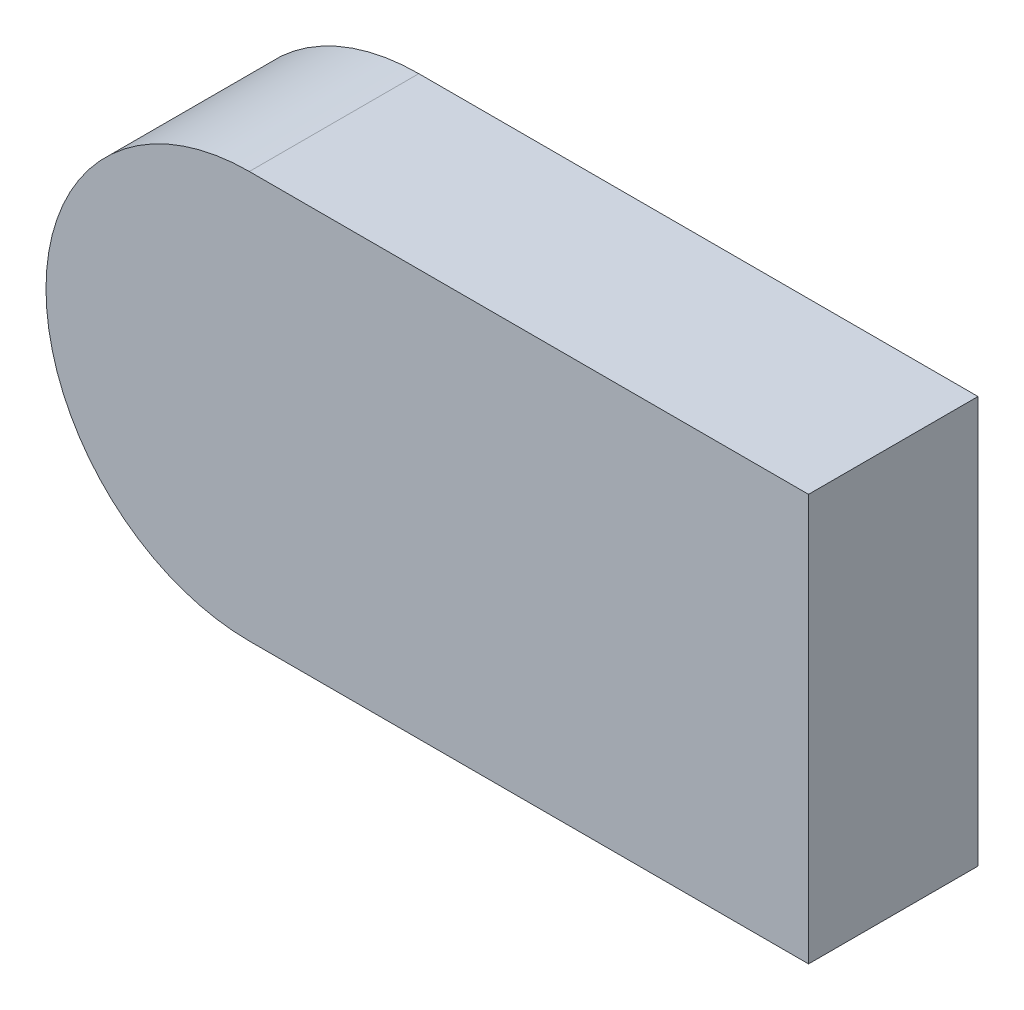
ISO-10303-21;
HEADER;
FILE_DESCRIPTION(('STEP AP214'),'2;1');
FILE_NAME('part.step','',(''),(''),'','','');
FILE_SCHEMA(('AUTOMOTIVE_DESIGN { 1 0 10303 214 1 1 1 1 }'));
ENDSEC;
DATA;
#1=APPLICATION_CONTEXT('core data for automotive mechanical design processes');
#2=APPLICATION_PROTOCOL_DEFINITION('international standard','automotive_design',2000,#1);
#3=PRODUCT_CONTEXT('',#1,'mechanical');
#4=PRODUCT('Part','Part','',(#3));
#5=PRODUCT_RELATED_PRODUCT_CATEGORY('part','',(#4));
#6=PRODUCT_DEFINITION_FORMATION('','',#4);
#7=PRODUCT_DEFINITION_CONTEXT('part definition',#1,'design');
#8=PRODUCT_DEFINITION('design','',#6,#7);
#9=PRODUCT_DEFINITION_SHAPE('','',#8);
#10=(LENGTH_UNIT() NAMED_UNIT(*) SI_UNIT(.MILLI.,.METRE.));
#11=(NAMED_UNIT(*) PLANE_ANGLE_UNIT() SI_UNIT($,.RADIAN.));
#12=(NAMED_UNIT(*) SI_UNIT($,.STERADIAN.) SOLID_ANGLE_UNIT());
#13=UNCERTAINTY_MEASURE_WITH_UNIT(LENGTH_MEASURE(1.E-05),#10,'distance_accuracy_value','');
#14=(GEOMETRIC_REPRESENTATION_CONTEXT(3) GLOBAL_UNCERTAINTY_ASSIGNED_CONTEXT((#13)) GLOBAL_UNIT_ASSIGNED_CONTEXT((#10,
#11,#12)) REPRESENTATION_CONTEXT('',''));
#15=CARTESIAN_POINT('',(0.,0.,0.));
#16=DIRECTION('',(0.,0.,1.));
#17=DIRECTION('',(1.,0.,0.));
#18=AXIS2_PLACEMENT_3D('',#15,#16,#17);
#19=CARTESIAN_POINT('',(4.05,-2.87,0.));
#20=DIRECTION('',(0.,-1.,0.));
#21=DIRECTION('',(-1.,0.,0.));
#22=AXIS2_PLACEMENT_3D('',#19,#20,#21);
#23=PLANE('',#22);
#24=DIRECTION('',(0.,0.,1.));
#25=VECTOR('',#24,1.);
#26=CARTESIAN_POINT('',(4.05,-2.87,0.));
#27=LINE('',#26,#25);
#28=CARTESIAN_POINT('',(4.05,-2.87,0.));
#29=VERTEX_POINT('',#28);
#30=CARTESIAN_POINT('',(4.05,-2.87,0.1));
#31=VERTEX_POINT('',#30);
#32=EDGE_CURVE('E11',#29,#31,#27,.T.);
#33=ORIENTED_EDGE('',*,*,#32,.T.);
#34=DIRECTION('',(-1.,0.,0.));
#35=VECTOR('',#34,1.);
#36=CARTESIAN_POINT('',(4.05,-2.87,0.1));
#37=LINE('',#36,#35);
#38=CARTESIAN_POINT('',(3.72,-2.87,0.1));
#39=VERTEX_POINT('',#38);
#40=EDGE_CURVE('E24',#31,#39,#37,.T.);
#41=ORIENTED_EDGE('',*,*,#40,.T.);
#42=DIRECTION('',(0.,0.,1.));
#43=VECTOR('',#42,1.);
#44=CARTESIAN_POINT('',(3.72,-2.87,0.));
#45=LINE('',#44,#43);
#46=CARTESIAN_POINT('',(3.72,-2.87,0.));
#47=VERTEX_POINT('',#46);
#48=EDGE_CURVE('E86',#47,#39,#45,.T.);
#49=ORIENTED_EDGE('',*,*,#48,.F.);
#50=DIRECTION('',(-1.,0.,0.));
#51=VECTOR('',#50,1.);
#52=CARTESIAN_POINT('',(4.05,-2.87,0.));
#53=LINE('',#52,#51);
#54=EDGE_CURVE('E83',#29,#47,#53,.T.);
#55=ORIENTED_EDGE('',*,*,#54,.F.);
#56=EDGE_LOOP('',(#33,#41,#49,#55));
#57=FACE_BOUND('',#56,.T.);
#58=ADVANCED_FACE('F17',(#57),#23,.T.);
#59=CARTESIAN_POINT('',(3.72,-2.75,0.));
#60=DIRECTION('',(0.,0.,-1.));
#61=DIRECTION('',(1.,0.,0.));
#62=AXIS2_PLACEMENT_3D('',#59,#60,#61);
#63=CYLINDRICAL_SURFACE('',#62,0.12);
#64=CARTESIAN_POINT('',(3.72,-2.75,0.));
#65=DIRECTION('',(0.,0.,1.));
#66=DIRECTION('',(1.,0.,0.));
#67=AXIS2_PLACEMENT_3D('',#64,#65,#66);
#68=CIRCLE('',#67,0.12);
#69=CARTESIAN_POINT('',(3.72,-2.63,0.));
#70=VERTEX_POINT('',#69);
#71=EDGE_CURVE('E80',#70,#47,#68,.T.);
#72=ORIENTED_EDGE('',*,*,#71,.T.);
#73=ORIENTED_EDGE('',*,*,#48,.T.);
#74=CARTESIAN_POINT('',(3.72,-2.75,0.1));
#75=DIRECTION('',(0.,0.,1.));
#76=DIRECTION('',(1.,0.,0.));
#77=AXIS2_PLACEMENT_3D('',#74,#75,#76);
#78=CIRCLE('',#77,0.12);
#79=CARTESIAN_POINT('',(3.72,-2.63,0.1));
#80=VERTEX_POINT('',#79);
#81=EDGE_CURVE('E78',#80,#39,#78,.T.);
#82=ORIENTED_EDGE('',*,*,#81,.F.);
#83=DIRECTION('',(0.,0.,1.));
#84=VECTOR('',#83,1.);
#85=CARTESIAN_POINT('',(3.72,-2.63,0.));
#86=LINE('',#85,#84);
#87=EDGE_CURVE('E67',#70,#80,#86,.T.);
#88=ORIENTED_EDGE('',*,*,#87,.F.);
#89=EDGE_LOOP('',(#72,#73,#82,#88));
#90=FACE_BOUND('',#89,.T.);
#91=ADVANCED_FACE('F89',(#90),#63,.T.);
#92=CARTESIAN_POINT('',(4.05,-2.63,0.));
#93=DIRECTION('',(0.,-1.,0.));
#94=DIRECTION('',(-1.,0.,0.));
#95=AXIS2_PLACEMENT_3D('',#92,#93,#94);
#96=PLANE('',#95);
#97=DIRECTION('',(-1.,0.,0.));
#98=VECTOR('',#97,1.);
#99=CARTESIAN_POINT('',(4.05,-2.63,0.));
#100=LINE('',#99,#98);
#101=CARTESIAN_POINT('',(4.05,-2.63,0.));
#102=VERTEX_POINT('',#101);
#103=EDGE_CURVE('E70',#102,#70,#100,.T.);
#104=ORIENTED_EDGE('',*,*,#103,.T.);
#105=ORIENTED_EDGE('',*,*,#87,.T.);
#106=DIRECTION('',(-1.,0.,0.));
#107=VECTOR('',#106,1.);
#108=CARTESIAN_POINT('',(4.05,-2.63,0.1));
#109=LINE('',#108,#107);
#110=CARTESIAN_POINT('',(4.05,-2.63,0.1));
#111=VERTEX_POINT('',#110);
#112=EDGE_CURVE('E61',#111,#80,#109,.T.);
#113=ORIENTED_EDGE('',*,*,#112,.F.);
#114=DIRECTION('',(0.,0.,1.));
#115=VECTOR('',#114,1.);
#116=CARTESIAN_POINT('',(4.05,-2.63,0.));
#117=LINE('',#116,#115);
#118=EDGE_CURVE('E51',#102,#111,#117,.T.);
#119=ORIENTED_EDGE('',*,*,#118,.F.);
#120=EDGE_LOOP('',(#104,#105,#113,#119));
#121=FACE_BOUND('',#120,.T.);
#122=ADVANCED_FACE('F65',(#121),#96,.F.);
#123=CARTESIAN_POINT('',(4.05,-2.87,0.));
#124=DIRECTION('',(-1.,0.,0.));
#125=DIRECTION('',(0.,1.,0.));
#126=AXIS2_PLACEMENT_3D('',#123,#124,#125);
#127=PLANE('',#126);
#128=DIRECTION('',(0.,1.,0.));
#129=VECTOR('',#128,1.);
#130=CARTESIAN_POINT('',(4.05,-2.87,0.));
#131=LINE('',#130,#129);
#132=EDGE_CURVE('E57',#29,#102,#131,.T.);
#133=ORIENTED_EDGE('',*,*,#132,.T.);
#134=ORIENTED_EDGE('',*,*,#118,.T.);
#135=DIRECTION('',(0.,1.,0.));
#136=VECTOR('',#135,1.);
#137=CARTESIAN_POINT('',(4.05,-2.87,0.1));
#138=LINE('',#137,#136);
#139=EDGE_CURVE('E55',#31,#111,#138,.T.);
#140=ORIENTED_EDGE('',*,*,#139,.F.);
#141=ORIENTED_EDGE('',*,*,#32,.F.);
#142=EDGE_LOOP('',(#133,#134,#140,#141));
#143=FACE_BOUND('',#142,.T.);
#144=ADVANCED_FACE('F53',(#143),#127,.F.);
#145=CARTESIAN_POINT('',(3.849490847913,-2.75,0.));
#146=DIRECTION('',(0.,0.,-1.));
#147=DIRECTION('',(-1.,0.,0.));
#148=AXIS2_PLACEMENT_3D('',#145,#146,#147);
#149=PLANE('',#148);
#150=ORIENTED_EDGE('',*,*,#54,.T.);
#151=ORIENTED_EDGE('',*,*,#71,.F.);
#152=ORIENTED_EDGE('',*,*,#103,.F.);
#153=ORIENTED_EDGE('',*,*,#132,.F.);
#154=EDGE_LOOP('',(#150,#151,#152,#153));
#155=FACE_BOUND('',#154,.T.);
#156=ADVANCED_FACE('F91',(#155),#149,.T.);
#157=CARTESIAN_POINT('',(3.849490847913,-2.75,0.1));
#158=DIRECTION('',(0.,0.,-1.));
#159=DIRECTION('',(-1.,0.,0.));
#160=AXIS2_PLACEMENT_3D('',#157,#158,#159);
#161=PLANE('',#160);
#162=ORIENTED_EDGE('',*,*,#139,.T.);
#163=ORIENTED_EDGE('',*,*,#112,.T.);
#164=ORIENTED_EDGE('',*,*,#81,.T.);
#165=ORIENTED_EDGE('',*,*,#40,.F.);
#166=EDGE_LOOP('',(#162,#163,#164,#165));
#167=FACE_BOUND('',#166,.T.);
#168=ADVANCED_FACE('F72',(#167),#161,.F.);
#169=CLOSED_SHELL('',(#58,#91,#122,#144,#156,#168));
#170=MANIFOLD_SOLID_BREP('B1',#169);
#171=ADVANCED_BREP_SHAPE_REPRESENTATION('',(#18,#170),#14);
#172=SHAPE_DEFINITION_REPRESENTATION(#9,#171);
ENDSEC;
END-ISO-10303-21;
